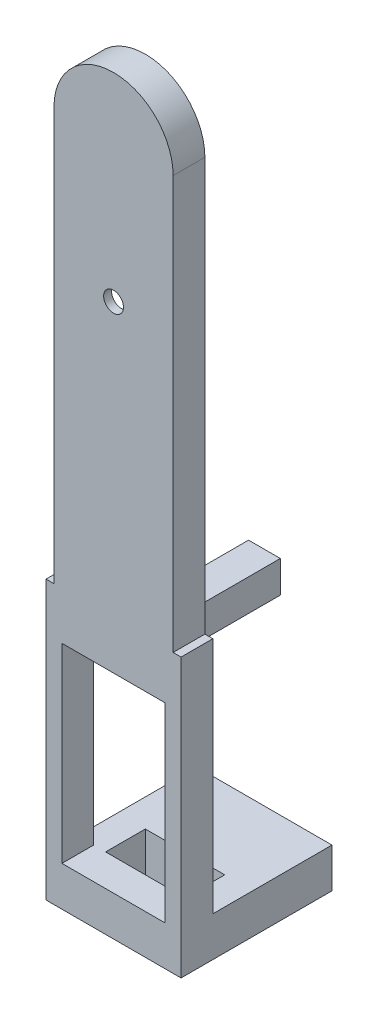
ISO-10303-21;
HEADER;
FILE_DESCRIPTION(('STEP AP214'),'2;1');
FILE_NAME('part.step','',(''),(''),'','','');
FILE_SCHEMA(('AUTOMOTIVE_DESIGN { 1 0 10303 214 1 1 1 1 }'));
ENDSEC;
DATA;
#1=APPLICATION_CONTEXT('core data for automotive mechanical design processes');
#2=APPLICATION_PROTOCOL_DEFINITION('international standard','automotive_design',2000,#1);
#3=PRODUCT_CONTEXT('',#1,'mechanical');
#4=PRODUCT('Part','Part','',(#3));
#5=PRODUCT_RELATED_PRODUCT_CATEGORY('part','',(#4));
#6=PRODUCT_DEFINITION_FORMATION('','',#4);
#7=PRODUCT_DEFINITION_CONTEXT('part definition',#1,'design');
#8=PRODUCT_DEFINITION('design','',#6,#7);
#9=PRODUCT_DEFINITION_SHAPE('','',#8);
#10=(LENGTH_UNIT() NAMED_UNIT(*) SI_UNIT(.MILLI.,.METRE.));
#11=(NAMED_UNIT(*) PLANE_ANGLE_UNIT() SI_UNIT($,.RADIAN.));
#12=(NAMED_UNIT(*) SI_UNIT($,.STERADIAN.) SOLID_ANGLE_UNIT());
#13=UNCERTAINTY_MEASURE_WITH_UNIT(LENGTH_MEASURE(1.E-05),#10,'distance_accuracy_value','');
#14=(GEOMETRIC_REPRESENTATION_CONTEXT(3) GLOBAL_UNCERTAINTY_ASSIGNED_CONTEXT((#13)) GLOBAL_UNIT_ASSIGNED_CONTEXT((#10,
#11,#12)) REPRESENTATION_CONTEXT('',''));
#15=CARTESIAN_POINT('',(0.,0.,0.));
#16=DIRECTION('',(0.,0.,1.));
#17=DIRECTION('',(1.,0.,0.));
#18=AXIS2_PLACEMENT_3D('',#15,#16,#17);
#19=CARTESIAN_POINT('',(0.,52.,0.));
#20=DIRECTION('',(0.,0.,1.));
#21=DIRECTION('',(1.,0.,0.));
#22=AXIS2_PLACEMENT_3D('',#19,#20,#21);
#23=PLANE('',#22);
#24=DIRECTION('',(1.,0.,0.));
#25=VECTOR('',#24,1.);
#26=CARTESIAN_POINT('',(-6.49999999999999,-30.,0.));
#27=LINE('',#26,#25);
#28=CARTESIAN_POINT('',(-5.,-30.,0.));
#29=VERTEX_POINT('',#28);
#30=CARTESIAN_POINT('',(5.,-30.,0.));
#31=VERTEX_POINT('',#30);
#32=EDGE_CURVE('E319',#29,#31,#27,.T.);
#33=ORIENTED_EDGE('',*,*,#32,.T.);
#34=DIRECTION('',(0.,-1.,0.));
#35=VECTOR('',#34,1.);
#36=CARTESIAN_POINT('',(5.,-30.,0.));
#37=LINE('',#36,#35);
#38=CARTESIAN_POINT('',(5.,-35.,0.));
#39=VERTEX_POINT('',#38);
#40=EDGE_CURVE('E248',#31,#39,#37,.T.);
#41=ORIENTED_EDGE('',*,*,#40,.T.);
#42=DIRECTION('',(1.,0.,0.));
#43=VECTOR('',#42,1.);
#44=CARTESIAN_POINT('',(8.50000000000001,-35.,0.));
#45=LINE('',#44,#43);
#46=CARTESIAN_POINT('',(-5.,-35.,0.));
#47=VERTEX_POINT('',#46);
#48=EDGE_CURVE('E354',#47,#39,#45,.T.);
#49=ORIENTED_EDGE('',*,*,#48,.F.);
#50=DIRECTION('',(0.,-1.,0.));
#51=VECTOR('',#50,1.);
#52=CARTESIAN_POINT('',(-5.,-30.,0.));
#53=LINE('',#52,#51);
#54=EDGE_CURVE('E276',#29,#47,#53,.T.);
#55=ORIENTED_EDGE('',*,*,#54,.F.);
#56=EDGE_LOOP('',(#33,#41,#49,#55));
#57=FACE_BOUND('',#56,.T.);
#58=ADVANCED_FACE('F38',(#57),#23,.F.);
#59=CARTESIAN_POINT('',(0.,52.,4.));
#60=DIRECTION('',(0.,0.,1.));
#61=DIRECTION('',(1.,0.,0.));
#62=AXIS2_PLACEMENT_3D('',#59,#60,#61);
#63=PLANE('',#62);
#64=CARTESIAN_POINT('',(0.,34.5,4.));
#65=DIRECTION('',(0.,0.,1.));
#66=DIRECTION('',(1.,0.,0.));
#67=AXIS2_PLACEMENT_3D('',#64,#65,#66);
#68=CIRCLE('',#67,1.25);
#69=CARTESIAN_POINT('',(1.25,34.5,4.));
#70=VERTEX_POINT('',#69);
#71=EDGE_CURVE('E381',#70,#70,#68,.F.);
#72=ORIENTED_EDGE('',*,*,#71,.T.);
#73=EDGE_LOOP('',(#72));
#74=FACE_BOUND('',#73,.T.);
#75=DIRECTION('',(0.,-1.,0.));
#76=VECTOR('',#75,1.);
#77=CARTESIAN_POINT('',(-7.5,0.,4.));
#78=LINE('',#77,#76);
#79=CARTESIAN_POINT('',(-7.5,52.,4.));
#80=VERTEX_POINT('',#79);
#81=CARTESIAN_POINT('',(-7.5,0.,4.));
#82=VERTEX_POINT('',#81);
#83=EDGE_CURVE('E434',#80,#82,#78,.T.);
#84=ORIENTED_EDGE('',*,*,#83,.T.);
#85=DIRECTION('',(-1.,0.,0.));
#86=VECTOR('',#85,1.);
#87=CARTESIAN_POINT('',(8.50000000000001,0.,4.));
#88=LINE('',#87,#86);
#89=CARTESIAN_POINT('',(-8.49999999999999,0.,4.));
#90=VERTEX_POINT('',#89);
#91=EDGE_CURVE('E353',#82,#90,#88,.T.);
#92=ORIENTED_EDGE('',*,*,#91,.T.);
#93=DIRECTION('',(0.,-1.,0.));
#94=VECTOR('',#93,1.);
#95=CARTESIAN_POINT('',(-8.49999999999999,0.,4.));
#96=LINE('',#95,#94);
#97=CARTESIAN_POINT('',(-8.49999999999999,-35.,4.));
#98=VERTEX_POINT('',#97);
#99=EDGE_CURVE('E358',#90,#98,#96,.T.);
#100=ORIENTED_EDGE('',*,*,#99,.T.);
#101=DIRECTION('',(1.,0.,0.));
#102=VECTOR('',#101,1.);
#103=CARTESIAN_POINT('',(8.50000000000001,-35.,4.));
#104=LINE('',#103,#102);
#105=CARTESIAN_POINT('',(8.50000000000001,-35.,4.));
#106=VERTEX_POINT('',#105);
#107=EDGE_CURVE('E360',#98,#106,#104,.T.);
#108=ORIENTED_EDGE('',*,*,#107,.T.);
#109=DIRECTION('',(0.,1.,0.));
#110=VECTOR('',#109,1.);
#111=CARTESIAN_POINT('',(8.50000000000001,0.,4.));
#112=LINE('',#111,#110);
#113=CARTESIAN_POINT('',(8.50000000000001,0.,4.));
#114=VERTEX_POINT('',#113);
#115=EDGE_CURVE('E350',#106,#114,#112,.T.);
#116=ORIENTED_EDGE('',*,*,#115,.T.);
#117=CARTESIAN_POINT('',(7.5,0.,4.));
#118=VERTEX_POINT('',#117);
#119=EDGE_CURVE('E355',#114,#118,#88,.T.);
#120=ORIENTED_EDGE('',*,*,#119,.T.);
#121=DIRECTION('',(0.,1.,0.));
#122=VECTOR('',#121,1.);
#123=CARTESIAN_POINT('',(7.5,0.,4.));
#124=LINE('',#123,#122);
#125=CARTESIAN_POINT('',(7.5,52.,4.));
#126=VERTEX_POINT('',#125);
#127=EDGE_CURVE('E429',#118,#126,#124,.T.);
#128=ORIENTED_EDGE('',*,*,#127,.T.);
#129=CARTESIAN_POINT('',(0.,52.,4.));
#130=DIRECTION('',(0.,0.,1.));
#131=DIRECTION('',(1.,0.,0.));
#132=AXIS2_PLACEMENT_3D('',#129,#130,#131);
#133=CIRCLE('',#132,7.5);
#134=EDGE_CURVE('E431',#126,#80,#133,.T.);
#135=ORIENTED_EDGE('',*,*,#134,.T.);
#136=EDGE_LOOP('',(#84,#92,#100,#108,#116,#120,#128,#135));
#137=FACE_BOUND('',#136,.T.);
#138=DIRECTION('',(-1.,0.,0.));
#139=VECTOR('',#138,1.);
#140=CARTESIAN_POINT('',(0.,-30.,4.));
#141=LINE('',#140,#139);
#142=CARTESIAN_POINT('',(6.50000000000001,-30.,4.));
#143=VERTEX_POINT('',#142);
#144=CARTESIAN_POINT('',(-6.49999999999999,-30.,4.));
#145=VERTEX_POINT('',#144);
#146=EDGE_CURVE('E344',#143,#145,#141,.T.);
#147=ORIENTED_EDGE('',*,*,#146,.T.);
#148=DIRECTION('',(0.,1.,0.));
#149=VECTOR('',#148,1.);
#150=CARTESIAN_POINT('',(-6.5,52.,4.));
#151=LINE('',#150,#149);
#152=CARTESIAN_POINT('',(-6.49999999999999,-6.,4.));
#153=VERTEX_POINT('',#152);
#154=EDGE_CURVE('E347',#145,#153,#151,.T.);
#155=ORIENTED_EDGE('',*,*,#154,.T.);
#156=DIRECTION('',(1.,0.,0.));
#157=VECTOR('',#156,1.);
#158=CARTESIAN_POINT('',(0.,-6.,4.));
#159=LINE('',#158,#157);
#160=CARTESIAN_POINT('',(6.50000000000001,-6.,4.));
#161=VERTEX_POINT('',#160);
#162=EDGE_CURVE('E338',#153,#161,#159,.T.);
#163=ORIENTED_EDGE('',*,*,#162,.T.);
#164=DIRECTION('',(0.,-1.,0.));
#165=VECTOR('',#164,1.);
#166=CARTESIAN_POINT('',(6.5,52.,4.));
#167=LINE('',#166,#165);
#168=EDGE_CURVE('E341',#161,#143,#167,.T.);
#169=ORIENTED_EDGE('',*,*,#168,.T.);
#170=EDGE_LOOP('',(#147,#155,#163,#169));
#171=FACE_BOUND('',#170,.T.);
#172=ADVANCED_FACE('F469',(#74,#137,#171),#63,.T.);
#173=DIRECTION('',(-0.161684528353418,0.986842496699009,0.));
#174=VECTOR('',#173,1.);
#175=CARTESIAN_POINT('',(10.3740127119628,1.69968090964537,0.));
#176=LINE('',#175,#174);
#177=CARTESIAN_POINT('',(5.,34.5,0.));
#178=VERTEX_POINT('',#177);
#179=CARTESIAN_POINT('',(2.13279550115704,52.,0.));
#180=VERTEX_POINT('',#179);
#181=EDGE_CURVE('E389',#178,#180,#176,.T.);
#182=ORIENTED_EDGE('',*,*,#181,.T.);
#183=CARTESIAN_POINT('',(0.,52.,0.));
#184=DIRECTION('',(0.,0.,1.));
#185=DIRECTION('',(1.,0.,0.));
#186=AXIS2_PLACEMENT_3D('',#183,#184,#185);
#187=CIRCLE('',#186,2.13279550115703);
#188=CARTESIAN_POINT('',(-2.13279550115703,52.,0.));
#189=VERTEX_POINT('',#188);
#190=EDGE_CURVE('E384',#189,#180,#187,.F.);
#191=ORIENTED_EDGE('',*,*,#190,.F.);
#192=DIRECTION('',(-0.161684528353418,-0.986842496699009,0.));
#193=VECTOR('',#192,1.);
#194=CARTESIAN_POINT('',(-10.3740127119628,1.69968090964537,0.));
#195=LINE('',#194,#193);
#196=CARTESIAN_POINT('',(-5.,34.5,0.));
#197=VERTEX_POINT('',#196);
#198=EDGE_CURVE('E402',#189,#197,#195,.T.);
#199=ORIENTED_EDGE('',*,*,#198,.T.);
#200=DIRECTION('',(0.161167236733303,-0.986927110684346,0.));
#201=VECTOR('',#200,1.);
#202=CARTESIAN_POINT('',(0.617455268354402,0.100831721339679,0.));
#203=LINE('',#202,#201);
#204=CARTESIAN_POINT('',(-2.14221383494361,17.,0.));
#205=VERTEX_POINT('',#204);
#206=EDGE_CURVE('E405',#197,#205,#203,.T.);
#207=ORIENTED_EDGE('',*,*,#206,.T.);
#208=CARTESIAN_POINT('',(0.,17.,0.));
#209=DIRECTION('',(0.,0.,1.));
#210=DIRECTION('',(1.,0.,0.));
#211=AXIS2_PLACEMENT_3D('',#208,#209,#210);
#212=CIRCLE('',#211,2.14221383494361);
#213=CARTESIAN_POINT('',(2.11474128897981,16.6580213525557,0.));
#214=VERTEX_POINT('',#213);
#215=EDGE_CURVE('E408',#205,#214,#212,.T.);
#216=ORIENTED_EDGE('',*,*,#215,.T.);
#217=DIRECTION('',(-0.159637960443524,-0.987175628541057,0.));
#218=VECTOR('',#217,1.);
#219=CARTESIAN_POINT('',(-0.564300677997616,0.091254085603361,0.));
#220=LINE('',#219,#218);
#221=EDGE_CURVE('E411',#178,#214,#220,.T.);
#222=ORIENTED_EDGE('',*,*,#221,.F.);
#223=EDGE_LOOP('',(#182,#191,#199,#207,#216,#222));
#224=FACE_BOUND('',#223,.T.);
#225=DIRECTION('',(0.,1.,0.));
#226=VECTOR('',#225,1.);
#227=CARTESIAN_POINT('',(8.50000000000001,0.,0.));
#228=LINE('',#227,#226);
#229=CARTESIAN_POINT('',(8.50000000000001,-30.,0.));
#230=VERTEX_POINT('',#229);
#231=CARTESIAN_POINT('',(8.50000000000001,0.,0.));
#232=VERTEX_POINT('',#231);
#233=EDGE_CURVE('E55',#230,#232,#228,.T.);
#234=ORIENTED_EDGE('',*,*,#233,.F.);
#235=DIRECTION('',(1.,0.,0.));
#236=VECTOR('',#235,1.);
#237=CARTESIAN_POINT('',(0.,-30.,0.));
#238=LINE('',#237,#236);
#239=CARTESIAN_POINT('',(6.50000000000001,-30.,0.));
#240=VERTEX_POINT('',#239);
#241=EDGE_CURVE('E252',#240,#230,#238,.T.);
#242=ORIENTED_EDGE('',*,*,#241,.F.);
#243=DIRECTION('',(0.,1.,0.));
#244=VECTOR('',#243,1.);
#245=CARTESIAN_POINT('',(6.50000000000001,-6.,0.));
#246=LINE('',#245,#244);
#247=CARTESIAN_POINT('',(6.50000000000001,-6.,0.));
#248=VERTEX_POINT('',#247);
#249=EDGE_CURVE('E321',#240,#248,#246,.T.);
#250=ORIENTED_EDGE('',*,*,#249,.T.);
#251=DIRECTION('',(-1.,0.,0.));
#252=VECTOR('',#251,1.);
#253=CARTESIAN_POINT('',(-6.49999999999999,-6.,0.));
#254=LINE('',#253,#252);
#255=CARTESIAN_POINT('',(2.00000000000001,-6.00000000000001,0.));
#256=VERTEX_POINT('',#255);
#257=EDGE_CURVE('E325',#248,#256,#254,.T.);
#258=ORIENTED_EDGE('',*,*,#257,.T.);
#259=DIRECTION('',(0.,1.,0.));
#260=VECTOR('',#259,1.);
#261=CARTESIAN_POINT('',(2.00000000000001,-2.00000000000001,0.));
#262=LINE('',#261,#260);
#263=CARTESIAN_POINT('',(2.00000000000001,-2.00000000000001,0.));
#264=VERTEX_POINT('',#263);
#265=EDGE_CURVE('E287',#256,#264,#262,.T.);
#266=ORIENTED_EDGE('',*,*,#265,.T.);
#267=DIRECTION('',(-1.,0.,0.));
#268=VECTOR('',#267,1.);
#269=CARTESIAN_POINT('',(2.00000000000001,-2.00000000000001,0.));
#270=LINE('',#269,#268);
#271=CARTESIAN_POINT('',(-1.99999999999999,-2.00000000000001,0.));
#272=VERTEX_POINT('',#271);
#273=EDGE_CURVE('E305',#264,#272,#270,.T.);
#274=ORIENTED_EDGE('',*,*,#273,.T.);
#275=DIRECTION('',(0.,-1.,0.));
#276=VECTOR('',#275,1.);
#277=CARTESIAN_POINT('',(-1.99999999999999,-2.00000000000001,0.));
#278=LINE('',#277,#276);
#279=CARTESIAN_POINT('',(-1.99999999999999,-6.,0.));
#280=VERTEX_POINT('',#279);
#281=EDGE_CURVE('E293',#272,#280,#278,.T.);
#282=ORIENTED_EDGE('',*,*,#281,.T.);
#283=CARTESIAN_POINT('',(-6.49999999999999,-6.,0.));
#284=VERTEX_POINT('',#283);
#285=EDGE_CURVE('E324',#280,#284,#254,.T.);
#286=ORIENTED_EDGE('',*,*,#285,.T.);
#287=DIRECTION('',(0.,-1.,0.));
#288=VECTOR('',#287,1.);
#289=CARTESIAN_POINT('',(-6.49999999999999,-6.,0.));
#290=LINE('',#289,#288);
#291=CARTESIAN_POINT('',(-6.49999999999999,-30.,0.));
#292=VERTEX_POINT('',#291);
#293=EDGE_CURVE('E312',#284,#292,#290,.T.);
#294=ORIENTED_EDGE('',*,*,#293,.T.);
#295=DIRECTION('',(1.,0.,0.));
#296=VECTOR('',#295,1.);
#297=CARTESIAN_POINT('',(0.,-30.,0.));
#298=LINE('',#297,#296);
#299=CARTESIAN_POINT('',(-8.49999999999999,-30.,0.));
#300=VERTEX_POINT('',#299);
#301=EDGE_CURVE('E62',#300,#292,#298,.T.);
#302=ORIENTED_EDGE('',*,*,#301,.F.);
#303=DIRECTION('',(0.,-1.,0.));
#304=VECTOR('',#303,1.);
#305=CARTESIAN_POINT('',(-8.49999999999999,0.,0.));
#306=LINE('',#305,#304);
#307=CARTESIAN_POINT('',(-8.49999999999999,0.,0.));
#308=VERTEX_POINT('',#307);
#309=EDGE_CURVE('E368',#308,#300,#306,.T.);
#310=ORIENTED_EDGE('',*,*,#309,.F.);
#311=DIRECTION('',(-1.,0.,0.));
#312=VECTOR('',#311,1.);
#313=CARTESIAN_POINT('',(8.50000000000001,0.,0.));
#314=LINE('',#313,#312);
#315=CARTESIAN_POINT('',(-7.5,0.,0.));
#316=VERTEX_POINT('',#315);
#317=EDGE_CURVE('E364',#316,#308,#314,.T.);
#318=ORIENTED_EDGE('',*,*,#317,.F.);
#319=DIRECTION('',(0.,-1.,0.));
#320=VECTOR('',#319,1.);
#321=CARTESIAN_POINT('',(-7.5,0.,0.));
#322=LINE('',#321,#320);
#323=CARTESIAN_POINT('',(-7.5,52.,0.));
#324=VERTEX_POINT('',#323);
#325=EDGE_CURVE('E432',#324,#316,#322,.T.);
#326=ORIENTED_EDGE('',*,*,#325,.F.);
#327=CARTESIAN_POINT('',(0.,52.,0.));
#328=DIRECTION('',(0.,0.,1.));
#329=DIRECTION('',(1.,0.,0.));
#330=AXIS2_PLACEMENT_3D('',#327,#328,#329);
#331=CIRCLE('',#330,7.5);
#332=CARTESIAN_POINT('',(7.5,52.,0.));
#333=VERTEX_POINT('',#332);
#334=EDGE_CURVE('E438',#333,#324,#331,.T.);
#335=ORIENTED_EDGE('',*,*,#334,.F.);
#336=DIRECTION('',(0.,1.,0.));
#337=VECTOR('',#336,1.);
#338=CARTESIAN_POINT('',(7.5,0.,0.));
#339=LINE('',#338,#337);
#340=CARTESIAN_POINT('',(7.5,0.,0.));
#341=VERTEX_POINT('',#340);
#342=EDGE_CURVE('E428',#341,#333,#339,.T.);
#343=ORIENTED_EDGE('',*,*,#342,.F.);
#344=EDGE_CURVE('E365',#232,#341,#314,.T.);
#345=ORIENTED_EDGE('',*,*,#344,.F.);
#346=EDGE_LOOP('',(#234,#242,#250,#258,#266,#274,#282,#286,#294,#302,#310,#318,#326,#335,#343,#345));
#347=FACE_BOUND('',#346,.T.);
#348=ADVANCED_FACE('F455',(#224,#347),#23,.F.);
#349=CARTESIAN_POINT('',(7.5,0.,4.));
#350=DIRECTION('',(-1.,0.,0.));
#351=DIRECTION('',(0.,0.,1.));
#352=AXIS2_PLACEMENT_3D('',#349,#350,#351);
#353=PLANE('',#352);
#354=ORIENTED_EDGE('',*,*,#342,.T.);
#355=DIRECTION('',(0.,0.,-1.));
#356=VECTOR('',#355,1.);
#357=CARTESIAN_POINT('',(7.5,52.,4.));
#358=LINE('',#357,#356);
#359=EDGE_CURVE('E446',#126,#333,#358,.T.);
#360=ORIENTED_EDGE('',*,*,#359,.F.);
#361=ORIENTED_EDGE('',*,*,#127,.F.);
#362=DIRECTION('',(0.,0.,-1.));
#363=VECTOR('',#362,1.);
#364=CARTESIAN_POINT('',(7.5,0.,4.));
#365=LINE('',#364,#363);
#366=EDGE_CURVE('E47',#118,#341,#365,.T.);
#367=ORIENTED_EDGE('',*,*,#366,.T.);
#368=EDGE_LOOP('',(#354,#360,#361,#367));
#369=FACE_BOUND('',#368,.T.);
#370=ADVANCED_FACE('F40',(#369),#353,.F.);
#371=CARTESIAN_POINT('',(0.,52.,4.));
#372=DIRECTION('',(0.,0.,-1.));
#373=DIRECTION('',(-1.,0.,0.));
#374=AXIS2_PLACEMENT_3D('',#371,#372,#373);
#375=CYLINDRICAL_SURFACE('',#374,7.5);
#376=ORIENTED_EDGE('',*,*,#334,.T.);
#377=DIRECTION('',(0.,0.,-1.));
#378=VECTOR('',#377,1.);
#379=CARTESIAN_POINT('',(-7.5,52.,4.));
#380=LINE('',#379,#378);
#381=EDGE_CURVE('E443',#80,#324,#380,.T.);
#382=ORIENTED_EDGE('',*,*,#381,.F.);
#383=ORIENTED_EDGE('',*,*,#134,.F.);
#384=ORIENTED_EDGE('',*,*,#359,.T.);
#385=EDGE_LOOP('',(#376,#382,#383,#384));
#386=FACE_BOUND('',#385,.T.);
#387=ADVANCED_FACE('F461',(#386),#375,.T.);
#388=CARTESIAN_POINT('',(-7.5,0.,4.));
#389=DIRECTION('',(1.,0.,0.));
#390=DIRECTION('',(0.,0.,-1.));
#391=AXIS2_PLACEMENT_3D('',#388,#389,#390);
#392=PLANE('',#391);
#393=ORIENTED_EDGE('',*,*,#325,.T.);
#394=DIRECTION('',(0.,0.,-1.));
#395=VECTOR('',#394,1.);
#396=CARTESIAN_POINT('',(-7.5,0.,4.));
#397=LINE('',#396,#395);
#398=EDGE_CURVE('E436',#82,#316,#397,.T.);
#399=ORIENTED_EDGE('',*,*,#398,.F.);
#400=ORIENTED_EDGE('',*,*,#83,.F.);
#401=ORIENTED_EDGE('',*,*,#381,.T.);
#402=EDGE_LOOP('',(#393,#399,#400,#401));
#403=FACE_BOUND('',#402,.T.);
#404=ADVANCED_FACE('F465',(#403),#392,.F.);
#405=CARTESIAN_POINT('',(0.,52.,3.));
#406=DIRECTION('',(0.,0.,-1.));
#407=DIRECTION('',(-1.,0.,0.));
#408=AXIS2_PLACEMENT_3D('',#405,#406,#407);
#409=CYLINDRICAL_SURFACE('',#408,2.13279550115703);
#410=ORIENTED_EDGE('',*,*,#190,.T.);
#411=DIRECTION('',(0.,0.,-1.));
#412=VECTOR('',#411,1.);
#413=CARTESIAN_POINT('',(2.13279550115704,52.,3.));
#414=LINE('',#413,#412);
#415=CARTESIAN_POINT('',(2.13279550115704,52.,3.));
#416=VERTEX_POINT('',#415);
#417=EDGE_CURVE('E400',#416,#180,#414,.T.);
#418=ORIENTED_EDGE('',*,*,#417,.F.);
#419=CARTESIAN_POINT('',(0.,52.,3.));
#420=DIRECTION('',(0.,0.,1.));
#421=DIRECTION('',(1.,0.,0.));
#422=AXIS2_PLACEMENT_3D('',#419,#420,#421);
#423=CIRCLE('',#422,2.13279550115703);
#424=CARTESIAN_POINT('',(-2.13279550115703,52.,3.));
#425=VERTEX_POINT('',#424);
#426=EDGE_CURVE('E385',#425,#416,#423,.F.);
#427=ORIENTED_EDGE('',*,*,#426,.F.);
#428=DIRECTION('',(0.,0.,-1.));
#429=VECTOR('',#428,1.);
#430=CARTESIAN_POINT('',(-2.13279550115703,52.,3.));
#431=LINE('',#430,#429);
#432=EDGE_CURVE('E426',#425,#189,#431,.T.);
#433=ORIENTED_EDGE('',*,*,#432,.T.);
#434=EDGE_LOOP('',(#410,#418,#427,#433));
#435=FACE_BOUND('',#434,.T.);
#436=ADVANCED_FACE('F520',(#435),#409,.F.);
#437=CARTESIAN_POINT('',(-10.3740127119628,1.69968090964537,3.));
#438=DIRECTION('',(0.986842496699008,-0.161684528353418,0.));
#439=DIRECTION('',(0.161684528353418,0.986842496699009,0.));
#440=AXIS2_PLACEMENT_3D('',#437,#438,#439);
#441=PLANE('',#440);
#442=ORIENTED_EDGE('',*,*,#198,.F.);
#443=ORIENTED_EDGE('',*,*,#432,.F.);
#444=DIRECTION('',(-0.161684528353418,-0.986842496699009,0.));
#445=VECTOR('',#444,1.);
#446=CARTESIAN_POINT('',(-10.3740127119628,1.69968090964537,3.));
#447=LINE('',#446,#445);
#448=CARTESIAN_POINT('',(-5.,34.5,3.));
#449=VERTEX_POINT('',#448);
#450=EDGE_CURVE('E388',#425,#449,#447,.T.);
#451=ORIENTED_EDGE('',*,*,#450,.T.);
#452=DIRECTION('',(0.,0.,-1.));
#453=VECTOR('',#452,1.);
#454=CARTESIAN_POINT('',(-5.,34.5,3.));
#455=LINE('',#454,#453);
#456=EDGE_CURVE('E424',#449,#197,#455,.T.);
#457=ORIENTED_EDGE('',*,*,#456,.T.);
#458=EDGE_LOOP('',(#442,#443,#451,#457));
#459=FACE_BOUND('',#458,.T.);
#460=ADVANCED_FACE('F691',(#459),#441,.T.);
#461=CARTESIAN_POINT('',(0.617455268354402,0.100831721339679,3.));
#462=DIRECTION('',(0.986927110684346,0.161167236733303,0.));
#463=DIRECTION('',(-0.161167236733303,0.986927110684346,0.));
#464=AXIS2_PLACEMENT_3D('',#461,#462,#463);
#465=PLANE('',#464);
#466=ORIENTED_EDGE('',*,*,#206,.F.);
#467=ORIENTED_EDGE('',*,*,#456,.F.);
#468=DIRECTION('',(0.161167236733303,-0.986927110684346,0.));
#469=VECTOR('',#468,1.);
#470=CARTESIAN_POINT('',(0.617455268354402,0.100831721339679,3.));
#471=LINE('',#470,#469);
#472=CARTESIAN_POINT('',(-2.14221383494361,17.,3.));
#473=VERTEX_POINT('',#472);
#474=EDGE_CURVE('E391',#449,#473,#471,.T.);
#475=ORIENTED_EDGE('',*,*,#474,.T.);
#476=DIRECTION('',(0.,0.,-1.));
#477=VECTOR('',#476,1.);
#478=CARTESIAN_POINT('',(-2.14221383494361,17.,3.));
#479=LINE('',#478,#477);
#480=EDGE_CURVE('E422',#473,#205,#479,.T.);
#481=ORIENTED_EDGE('',*,*,#480,.T.);
#482=EDGE_LOOP('',(#466,#467,#475,#481));
#483=FACE_BOUND('',#482,.T.);
#484=ADVANCED_FACE('F688',(#483),#465,.T.);
#485=CARTESIAN_POINT('',(0.,17.,3.));
#486=DIRECTION('',(0.,0.,-1.));
#487=DIRECTION('',(-1.,0.,0.));
#488=AXIS2_PLACEMENT_3D('',#485,#486,#487);
#489=CYLINDRICAL_SURFACE('',#488,2.14221383494361);
#490=ORIENTED_EDGE('',*,*,#215,.F.);
#491=ORIENTED_EDGE('',*,*,#480,.F.);
#492=CARTESIAN_POINT('',(0.,17.,3.));
#493=DIRECTION('',(0.,0.,1.));
#494=DIRECTION('',(1.,0.,0.));
#495=AXIS2_PLACEMENT_3D('',#492,#493,#494);
#496=CIRCLE('',#495,2.14221383494361);
#497=CARTESIAN_POINT('',(2.11474128897981,16.6580213525557,3.));
#498=VERTEX_POINT('',#497);
#499=EDGE_CURVE('E393',#473,#498,#496,.T.);
#500=ORIENTED_EDGE('',*,*,#499,.T.);
#501=DIRECTION('',(0.,0.,-1.));
#502=VECTOR('',#501,1.);
#503=CARTESIAN_POINT('',(2.11474128897981,16.6580213525557,3.));
#504=LINE('',#503,#502);
#505=EDGE_CURVE('E420',#498,#214,#504,.T.);
#506=ORIENTED_EDGE('',*,*,#505,.T.);
#507=EDGE_LOOP('',(#490,#491,#500,#506));
#508=FACE_BOUND('',#507,.T.);
#509=ADVANCED_FACE('F684',(#508),#489,.F.);
#510=CARTESIAN_POINT('',(-0.564300677997616,0.091254085603361,3.));
#511=DIRECTION('',(0.987175628541057,-0.159637960443524,0.));
#512=DIRECTION('',(0.159637960443524,0.987175628541057,0.));
#513=AXIS2_PLACEMENT_3D('',#510,#511,#512);
#514=PLANE('',#513);
#515=ORIENTED_EDGE('',*,*,#221,.T.);
#516=ORIENTED_EDGE('',*,*,#505,.F.);
#517=DIRECTION('',(-0.159637960443524,-0.987175628541057,0.));
#518=VECTOR('',#517,1.);
#519=CARTESIAN_POINT('',(-0.564300677997616,0.091254085603361,3.));
#520=LINE('',#519,#518);
#521=CARTESIAN_POINT('',(5.,34.5,3.));
#522=VERTEX_POINT('',#521);
#523=EDGE_CURVE('E395',#522,#498,#520,.T.);
#524=ORIENTED_EDGE('',*,*,#523,.F.);
#525=DIRECTION('',(0.,0.,-1.));
#526=VECTOR('',#525,1.);
#527=CARTESIAN_POINT('',(5.,34.5,3.));
#528=LINE('',#527,#526);
#529=EDGE_CURVE('E418',#522,#178,#528,.T.);
#530=ORIENTED_EDGE('',*,*,#529,.T.);
#531=EDGE_LOOP('',(#515,#516,#524,#530));
#532=FACE_BOUND('',#531,.T.);
#533=ADVANCED_FACE('F680',(#532),#514,.F.);
#534=CARTESIAN_POINT('',(10.3740127119628,1.69968090964537,3.));
#535=DIRECTION('',(-0.986842496699008,-0.161684528353418,0.));
#536=DIRECTION('',(0.161684528353418,-0.986842496699009,0.));
#537=AXIS2_PLACEMENT_3D('',#534,#535,#536);
#538=PLANE('',#537);
#539=ORIENTED_EDGE('',*,*,#181,.F.);
#540=ORIENTED_EDGE('',*,*,#529,.F.);
#541=DIRECTION('',(-0.161684528353418,0.986842496699009,0.));
#542=VECTOR('',#541,1.);
#543=CARTESIAN_POINT('',(10.3740127119628,1.69968090964537,3.));
#544=LINE('',#543,#542);
#545=EDGE_CURVE('E398',#522,#416,#544,.T.);
#546=ORIENTED_EDGE('',*,*,#545,.T.);
#547=ORIENTED_EDGE('',*,*,#417,.T.);
#548=EDGE_LOOP('',(#539,#540,#546,#547));
#549=FACE_BOUND('',#548,.T.);
#550=ADVANCED_FACE('F676',(#549),#538,.T.);
#551=CARTESIAN_POINT('',(0.,0.,3.));
#552=DIRECTION('',(0.,0.,1.));
#553=DIRECTION('',(1.,0.,0.));
#554=AXIS2_PLACEMENT_3D('',#551,#552,#553);
#555=PLANE('',#554);
#556=CARTESIAN_POINT('',(0.,34.5,3.));
#557=DIRECTION('',(0.,0.,1.));
#558=DIRECTION('',(1.,0.,0.));
#559=AXIS2_PLACEMENT_3D('',#556,#557,#558);
#560=CIRCLE('',#559,1.25);
#561=CARTESIAN_POINT('',(1.25,34.5,3.));
#562=VERTEX_POINT('',#561);
#563=EDGE_CURVE('E42',#562,#562,#560,.F.);
#564=ORIENTED_EDGE('',*,*,#563,.F.);
#565=EDGE_LOOP('',(#564));
#566=FACE_BOUND('',#565,.T.);
#567=ORIENTED_EDGE('',*,*,#426,.T.);
#568=ORIENTED_EDGE('',*,*,#545,.F.);
#569=ORIENTED_EDGE('',*,*,#523,.T.);
#570=ORIENTED_EDGE('',*,*,#499,.F.);
#571=ORIENTED_EDGE('',*,*,#474,.F.);
#572=ORIENTED_EDGE('',*,*,#450,.F.);
#573=EDGE_LOOP('',(#567,#568,#569,#570,#571,#572));
#574=FACE_BOUND('',#573,.T.);
#575=ADVANCED_FACE('F672',(#566,#574),#555,.F.);
#576=CARTESIAN_POINT('',(0.,34.5,12.4));
#577=DIRECTION('',(0.,0.,-1.));
#578=DIRECTION('',(-1.,0.,0.));
#579=AXIS2_PLACEMENT_3D('',#576,#577,#578);
#580=CYLINDRICAL_SURFACE('',#579,1.25);
#581=ORIENTED_EDGE('',*,*,#71,.F.);
#582=EDGE_LOOP('',(#581));
#583=FACE_BOUND('',#582,.T.);
#584=ORIENTED_EDGE('',*,*,#563,.T.);
#585=EDGE_LOOP('',(#584));
#586=FACE_BOUND('',#585,.T.);
#587=ADVANCED_FACE('F669',(#583,#586),#580,.F.);
#588=CARTESIAN_POINT('',(8.50000000000001,0.,4.));
#589=DIRECTION('',(0.,-1.,0.));
#590=DIRECTION('',(1.,0.,0.));
#591=AXIS2_PLACEMENT_3D('',#588,#589,#590);
#592=PLANE('',#591);
#593=ORIENTED_EDGE('',*,*,#91,.F.);
#594=ORIENTED_EDGE('',*,*,#398,.T.);
#595=ORIENTED_EDGE('',*,*,#317,.T.);
#596=DIRECTION('',(0.,0.,-1.));
#597=VECTOR('',#596,1.);
#598=CARTESIAN_POINT('',(-8.49999999999999,0.,4.));
#599=LINE('',#598,#597);
#600=EDGE_CURVE('E375',#90,#308,#599,.T.);
#601=ORIENTED_EDGE('',*,*,#600,.F.);
#602=EDGE_LOOP('',(#593,#594,#595,#601));
#603=FACE_BOUND('',#602,.T.);
#604=ADVANCED_FACE('F551',(#603),#592,.F.);
#605=CARTESIAN_POINT('',(8.50000000000001,0.,4.));
#606=DIRECTION('',(-1.,0.,0.));
#607=DIRECTION('',(0.,-1.,0.));
#608=AXIS2_PLACEMENT_3D('',#605,#606,#607);
#609=PLANE('',#608);
#610=DIRECTION('',(0.,0.,-1.));
#611=VECTOR('',#610,1.);
#612=CARTESIAN_POINT('',(8.50000000000001,-35.,4.));
#613=LINE('',#612,#611);
#614=CARTESIAN_POINT('',(8.50000000000001,-35.,-15.));
#615=VERTEX_POINT('',#614);
#616=EDGE_CURVE('E362',#106,#615,#613,.T.);
#617=ORIENTED_EDGE('',*,*,#616,.T.);
#618=DIRECTION('',(0.,-1.,0.));
#619=VECTOR('',#618,1.);
#620=CARTESIAN_POINT('',(8.50000000000001,-30.,-15.));
#621=LINE('',#620,#619);
#622=CARTESIAN_POINT('',(8.50000000000001,-30.,-15.));
#623=VERTEX_POINT('',#622);
#624=EDGE_CURVE('E282',#623,#615,#621,.T.);
#625=ORIENTED_EDGE('',*,*,#624,.F.);
#626=DIRECTION('',(0.,0.,-1.));
#627=VECTOR('',#626,1.);
#628=CARTESIAN_POINT('',(8.50000000000001,-30.,0.));
#629=LINE('',#628,#627);
#630=EDGE_CURVE('E254',#230,#623,#629,.T.);
#631=ORIENTED_EDGE('',*,*,#630,.F.);
#632=ORIENTED_EDGE('',*,*,#233,.T.);
#633=DIRECTION('',(0.,0.,-1.));
#634=VECTOR('',#633,1.);
#635=CARTESIAN_POINT('',(8.50000000000001,0.,4.));
#636=LINE('',#635,#634);
#637=EDGE_CURVE('E378',#114,#232,#636,.T.);
#638=ORIENTED_EDGE('',*,*,#637,.F.);
#639=ORIENTED_EDGE('',*,*,#115,.F.);
#640=EDGE_LOOP('',(#617,#625,#631,#632,#638,#639));
#641=FACE_BOUND('',#640,.T.);
#642=ADVANCED_FACE('F476',(#641),#609,.F.);
#643=ORIENTED_EDGE('',*,*,#366,.F.);
#644=ORIENTED_EDGE('',*,*,#119,.F.);
#645=ORIENTED_EDGE('',*,*,#637,.T.);
#646=ORIENTED_EDGE('',*,*,#344,.T.);
#647=EDGE_LOOP('',(#643,#644,#645,#646));
#648=FACE_BOUND('',#647,.T.);
#649=ADVANCED_FACE('F453',(#648),#592,.F.);
#650=CARTESIAN_POINT('',(-8.49999999999999,0.,4.));
#651=DIRECTION('',(1.,0.,0.));
#652=DIRECTION('',(0.,1.,0.));
#653=AXIS2_PLACEMENT_3D('',#650,#651,#652);
#654=PLANE('',#653);
#655=ORIENTED_EDGE('',*,*,#309,.T.);
#656=DIRECTION('',(0.,0.,1.));
#657=VECTOR('',#656,1.);
#658=CARTESIAN_POINT('',(-8.50000000000001,-30.,0.));
#659=LINE('',#658,#657);
#660=CARTESIAN_POINT('',(-8.50000000000001,-30.,-15.));
#661=VERTEX_POINT('',#660);
#662=EDGE_CURVE('E261',#661,#300,#659,.T.);
#663=ORIENTED_EDGE('',*,*,#662,.F.);
#664=DIRECTION('',(0.,-1.,0.));
#665=VECTOR('',#664,1.);
#666=CARTESIAN_POINT('',(-8.50000000000001,-30.,-15.));
#667=LINE('',#666,#665);
#668=CARTESIAN_POINT('',(-8.50000000000001,-35.,-15.));
#669=VERTEX_POINT('',#668);
#670=EDGE_CURVE('E279',#661,#669,#667,.T.);
#671=ORIENTED_EDGE('',*,*,#670,.T.);
#672=DIRECTION('',(0.,0.,-1.));
#673=VECTOR('',#672,1.);
#674=CARTESIAN_POINT('',(-8.49999999999999,-35.,4.));
#675=LINE('',#674,#673);
#676=EDGE_CURVE('E373',#98,#669,#675,.T.);
#677=ORIENTED_EDGE('',*,*,#676,.F.);
#678=ORIENTED_EDGE('',*,*,#99,.F.);
#679=ORIENTED_EDGE('',*,*,#600,.T.);
#680=EDGE_LOOP('',(#655,#663,#671,#677,#678,#679));
#681=FACE_BOUND('',#680,.T.);
#682=ADVANCED_FACE('F560',(#681),#654,.F.);
#683=CARTESIAN_POINT('',(8.50000000000001,-35.,4.));
#684=DIRECTION('',(0.,1.,0.));
#685=DIRECTION('',(0.,0.,1.));
#686=AXIS2_PLACEMENT_3D('',#683,#684,#685);
#687=PLANE('',#686);
#688=DIRECTION('',(-1.,0.,0.));
#689=VECTOR('',#688,1.);
#690=CARTESIAN_POINT('',(0.,-35.,-15.));
#691=LINE('',#690,#689);
#692=EDGE_CURVE('E271',#615,#669,#691,.T.);
#693=ORIENTED_EDGE('',*,*,#692,.F.);
#694=ORIENTED_EDGE('',*,*,#616,.F.);
#695=ORIENTED_EDGE('',*,*,#107,.F.);
#696=ORIENTED_EDGE('',*,*,#676,.T.);
#697=EDGE_LOOP('',(#693,#694,#695,#696));
#698=FACE_BOUND('',#697,.T.);
#699=ORIENTED_EDGE('',*,*,#48,.T.);
#700=DIRECTION('',(0.,0.,-1.));
#701=VECTOR('',#700,1.);
#702=CARTESIAN_POINT('',(5.,-35.,0.));
#703=LINE('',#702,#701);
#704=CARTESIAN_POINT('',(5.,-35.,-5.));
#705=VERTEX_POINT('',#704);
#706=EDGE_CURVE('E268',#39,#705,#703,.T.);
#707=ORIENTED_EDGE('',*,*,#706,.T.);
#708=DIRECTION('',(1.,0.,0.));
#709=VECTOR('',#708,1.);
#710=CARTESIAN_POINT('',(0.,-35.,-5.));
#711=LINE('',#710,#709);
#712=CARTESIAN_POINT('',(-5.,-35.,-5.));
#713=VERTEX_POINT('',#712);
#714=EDGE_CURVE('E243',#713,#705,#711,.T.);
#715=ORIENTED_EDGE('',*,*,#714,.F.);
#716=DIRECTION('',(0.,0.,-1.));
#717=VECTOR('',#716,1.);
#718=CARTESIAN_POINT('',(-5.,-35.,0.));
#719=LINE('',#718,#717);
#720=EDGE_CURVE('E237',#47,#713,#719,.T.);
#721=ORIENTED_EDGE('',*,*,#720,.F.);
#722=EDGE_LOOP('',(#699,#707,#715,#721));
#723=FACE_BOUND('',#722,.T.);
#724=ADVANCED_FACE('F564',(#698,#723),#687,.F.);
#725=CARTESIAN_POINT('',(-6.49999999999999,-6.,12.1));
#726=DIRECTION('',(1.,0.,0.));
#727=DIRECTION('',(0.,1.,0.));
#728=AXIS2_PLACEMENT_3D('',#725,#726,#727);
#729=PLANE('',#728);
#730=DIRECTION('',(0.,0.,-1.));
#731=VECTOR('',#730,1.);
#732=CARTESIAN_POINT('',(-6.49999999999999,-30.,12.1));
#733=LINE('',#732,#731);
#734=EDGE_CURVE('E336',#145,#292,#733,.T.);
#735=ORIENTED_EDGE('',*,*,#734,.T.);
#736=ORIENTED_EDGE('',*,*,#293,.F.);
#737=DIRECTION('',(0.,0.,-1.));
#738=VECTOR('',#737,1.);
#739=CARTESIAN_POINT('',(-6.49999999999999,-6.,12.1));
#740=LINE('',#739,#738);
#741=EDGE_CURVE('E328',#153,#284,#740,.T.);
#742=ORIENTED_EDGE('',*,*,#741,.F.);
#743=ORIENTED_EDGE('',*,*,#154,.F.);
#744=EDGE_LOOP('',(#735,#736,#742,#743));
#745=FACE_BOUND('',#744,.T.);
#746=ADVANCED_FACE('F506',(#745),#729,.T.);
#747=CARTESIAN_POINT('',(-6.49999999999999,-30.,12.1));
#748=DIRECTION('',(0.,1.,0.));
#749=DIRECTION('',(0.,0.,1.));
#750=AXIS2_PLACEMENT_3D('',#747,#748,#749);
#751=PLANE('',#750);
#752=DIRECTION('',(0.,0.,-1.));
#753=VECTOR('',#752,1.);
#754=CARTESIAN_POINT('',(6.50000000000001,-30.,12.1));
#755=LINE('',#754,#753);
#756=EDGE_CURVE('E333',#143,#240,#755,.T.);
#757=ORIENTED_EDGE('',*,*,#756,.T.);
#758=ORIENTED_EDGE('',*,*,#241,.T.);
#759=ORIENTED_EDGE('',*,*,#630,.T.);
#760=DIRECTION('',(-1.,0.,0.));
#761=VECTOR('',#760,1.);
#762=CARTESIAN_POINT('',(0.,-30.,-15.));
#763=LINE('',#762,#761);
#764=EDGE_CURVE('E259',#623,#661,#763,.T.);
#765=ORIENTED_EDGE('',*,*,#764,.T.);
#766=ORIENTED_EDGE('',*,*,#662,.T.);
#767=ORIENTED_EDGE('',*,*,#301,.T.);
#768=ORIENTED_EDGE('',*,*,#734,.F.);
#769=ORIENTED_EDGE('',*,*,#146,.F.);
#770=EDGE_LOOP('',(#757,#758,#759,#765,#766,#767,#768,#769));
#771=FACE_BOUND('',#770,.T.);
#772=DIRECTION('',(0.,0.,-1.));
#773=VECTOR('',#772,1.);
#774=CARTESIAN_POINT('',(5.,-30.,0.));
#775=LINE('',#774,#773);
#776=CARTESIAN_POINT('',(5.,-30.,-5.));
#777=VERTEX_POINT('',#776);
#778=EDGE_CURVE('E231',#31,#777,#775,.T.);
#779=ORIENTED_EDGE('',*,*,#778,.F.);
#780=ORIENTED_EDGE('',*,*,#32,.F.);
#781=DIRECTION('',(0.,0.,-1.));
#782=VECTOR('',#781,1.);
#783=CARTESIAN_POINT('',(-5.,-30.,0.));
#784=LINE('',#783,#782);
#785=CARTESIAN_POINT('',(-5.,-30.,-5.));
#786=VERTEX_POINT('',#785);
#787=EDGE_CURVE('E233',#29,#786,#784,.T.);
#788=ORIENTED_EDGE('',*,*,#787,.T.);
#789=DIRECTION('',(1.,0.,0.));
#790=VECTOR('',#789,1.);
#791=CARTESIAN_POINT('',(0.,-30.,-5.));
#792=LINE('',#791,#790);
#793=EDGE_CURVE('E227',#786,#777,#792,.T.);
#794=ORIENTED_EDGE('',*,*,#793,.T.);
#795=EDGE_LOOP('',(#779,#780,#788,#794));
#796=FACE_BOUND('',#795,.T.);
#797=ADVANCED_FACE('F229',(#771,#796),#751,.T.);
#798=CARTESIAN_POINT('',(6.50000000000001,-6.,12.1));
#799=DIRECTION('',(-1.,0.,0.));
#800=DIRECTION('',(0.,-1.,0.));
#801=AXIS2_PLACEMENT_3D('',#798,#799,#800);
#802=PLANE('',#801);
#803=DIRECTION('',(0.,0.,-1.));
#804=VECTOR('',#803,1.);
#805=CARTESIAN_POINT('',(6.50000000000001,-6.,12.1));
#806=LINE('',#805,#804);
#807=EDGE_CURVE('E331',#161,#248,#806,.T.);
#808=ORIENTED_EDGE('',*,*,#807,.T.);
#809=ORIENTED_EDGE('',*,*,#249,.F.);
#810=ORIENTED_EDGE('',*,*,#756,.F.);
#811=ORIENTED_EDGE('',*,*,#168,.F.);
#812=EDGE_LOOP('',(#808,#809,#810,#811));
#813=FACE_BOUND('',#812,.T.);
#814=ADVANCED_FACE('F485',(#813),#802,.T.);
#815=CARTESIAN_POINT('',(-6.49999999999999,-6.,12.1));
#816=DIRECTION('',(0.,-1.,0.));
#817=DIRECTION('',(0.,0.,-1.));
#818=AXIS2_PLACEMENT_3D('',#815,#816,#817);
#819=PLANE('',#818);
#820=ORIENTED_EDGE('',*,*,#741,.T.);
#821=ORIENTED_EDGE('',*,*,#285,.F.);
#822=DIRECTION('',(0.,0.,1.));
#823=VECTOR('',#822,1.);
#824=CARTESIAN_POINT('',(-1.99999999999999,-6.00000000000001,-15.));
#825=LINE('',#824,#823);
#826=CARTESIAN_POINT('',(-1.99999999999999,-6.00000000000001,-15.));
#827=VERTEX_POINT('',#826);
#828=EDGE_CURVE('E313',#827,#280,#825,.T.);
#829=ORIENTED_EDGE('',*,*,#828,.F.);
#830=DIRECTION('',(1.,0.,0.));
#831=VECTOR('',#830,1.);
#832=CARTESIAN_POINT('',(2.00000000000001,-6.00000000000001,-15.));
#833=LINE('',#832,#831);
#834=CARTESIAN_POINT('',(2.00000000000001,-6.00000000000001,-15.));
#835=VERTEX_POINT('',#834);
#836=EDGE_CURVE('E299',#827,#835,#833,.T.);
#837=ORIENTED_EDGE('',*,*,#836,.T.);
#838=DIRECTION('',(0.,0.,1.));
#839=VECTOR('',#838,1.);
#840=CARTESIAN_POINT('',(2.00000000000001,-6.00000000000001,-15.));
#841=LINE('',#840,#839);
#842=EDGE_CURVE('E310',#835,#256,#841,.T.);
#843=ORIENTED_EDGE('',*,*,#842,.T.);
#844=ORIENTED_EDGE('',*,*,#257,.F.);
#845=ORIENTED_EDGE('',*,*,#807,.F.);
#846=ORIENTED_EDGE('',*,*,#162,.F.);
#847=EDGE_LOOP('',(#820,#821,#829,#837,#843,#844,#845,#846));
#848=FACE_BOUND('',#847,.T.);
#849=ADVANCED_FACE('F488',(#848),#819,.T.);
#850=CARTESIAN_POINT('',(2.00000000000001,-2.00000000000001,-15.));
#851=DIRECTION('',(1.,0.,0.));
#852=DIRECTION('',(0.,1.,0.));
#853=AXIS2_PLACEMENT_3D('',#850,#851,#852);
#854=PLANE('',#853);
#855=ORIENTED_EDGE('',*,*,#265,.F.);
#856=ORIENTED_EDGE('',*,*,#842,.F.);
#857=DIRECTION('',(0.,1.,0.));
#858=VECTOR('',#857,1.);
#859=CARTESIAN_POINT('',(2.00000000000001,-2.00000000000001,-15.));
#860=LINE('',#859,#858);
#861=CARTESIAN_POINT('',(2.00000000000001,-2.00000000000001,-15.));
#862=VERTEX_POINT('',#861);
#863=EDGE_CURVE('E289',#835,#862,#860,.T.);
#864=ORIENTED_EDGE('',*,*,#863,.T.);
#865=DIRECTION('',(0.,0.,1.));
#866=VECTOR('',#865,1.);
#867=CARTESIAN_POINT('',(2.00000000000001,-2.00000000000001,-15.));
#868=LINE('',#867,#866);
#869=EDGE_CURVE('E302',#862,#264,#868,.T.);
#870=ORIENTED_EDGE('',*,*,#869,.T.);
#871=EDGE_LOOP('',(#855,#856,#864,#870));
#872=FACE_BOUND('',#871,.T.);
#873=ADVANCED_FACE('F493',(#872),#854,.T.);
#874=CARTESIAN_POINT('',(-1.99999999999999,-2.00000000000001,-15.));
#875=DIRECTION('',(-1.,0.,0.));
#876=DIRECTION('',(0.,-1.,0.));
#877=AXIS2_PLACEMENT_3D('',#874,#875,#876);
#878=PLANE('',#877);
#879=ORIENTED_EDGE('',*,*,#281,.F.);
#880=DIRECTION('',(0.,0.,1.));
#881=VECTOR('',#880,1.);
#882=CARTESIAN_POINT('',(-1.99999999999999,-2.00000000000001,-15.));
#883=LINE('',#882,#881);
#884=CARTESIAN_POINT('',(-1.99999999999999,-2.00000000000001,-15.));
#885=VERTEX_POINT('',#884);
#886=EDGE_CURVE('E315',#885,#272,#883,.T.);
#887=ORIENTED_EDGE('',*,*,#886,.F.);
#888=DIRECTION('',(0.,-1.,0.));
#889=VECTOR('',#888,1.);
#890=CARTESIAN_POINT('',(-1.99999999999999,-2.00000000000001,-15.));
#891=LINE('',#890,#889);
#892=EDGE_CURVE('E296',#885,#827,#891,.T.);
#893=ORIENTED_EDGE('',*,*,#892,.T.);
#894=ORIENTED_EDGE('',*,*,#828,.T.);
#895=EDGE_LOOP('',(#879,#887,#893,#894));
#896=FACE_BOUND('',#895,.T.);
#897=ADVANCED_FACE('F502',(#896),#878,.T.);
#898=CARTESIAN_POINT('',(2.00000000000001,-2.00000000000001,-15.));
#899=DIRECTION('',(0.,1.,0.));
#900=DIRECTION('',(-1.,0.,0.));
#901=AXIS2_PLACEMENT_3D('',#898,#899,#900);
#902=PLANE('',#901);
#903=ORIENTED_EDGE('',*,*,#273,.F.);
#904=ORIENTED_EDGE('',*,*,#869,.F.);
#905=DIRECTION('',(-1.,0.,0.));
#906=VECTOR('',#905,1.);
#907=CARTESIAN_POINT('',(2.00000000000001,-2.00000000000001,-15.));
#908=LINE('',#907,#906);
#909=EDGE_CURVE('E292',#862,#885,#908,.T.);
#910=ORIENTED_EDGE('',*,*,#909,.T.);
#911=ORIENTED_EDGE('',*,*,#886,.T.);
#912=EDGE_LOOP('',(#903,#904,#910,#911));
#913=FACE_BOUND('',#912,.T.);
#914=ADVANCED_FACE('F498',(#913),#902,.T.);
#915=CARTESIAN_POINT('',(0.,0.,-15.));
#916=DIRECTION('',(0.,0.,-1.));
#917=DIRECTION('',(-1.,0.,0.));
#918=AXIS2_PLACEMENT_3D('',#915,#916,#917);
#919=PLANE('',#918);
#920=CARTESIAN_POINT('',(0.,-4.00000000000001,-15.));
#921=DIRECTION('',(0.,0.,1.));
#922=DIRECTION('',(1.,0.,0.));
#923=AXIS2_PLACEMENT_3D('',#920,#921,#922);
#924=CIRCLE('',#923,1.15);
#925=CARTESIAN_POINT('',(1.15000000000001,-4.00000000000001,-15.));
#926=VERTEX_POINT('',#925);
#927=EDGE_CURVE('E247',#926,#926,#924,.T.);
#928=ORIENTED_EDGE('',*,*,#927,.T.);
#929=EDGE_LOOP('',(#928));
#930=FACE_BOUND('',#929,.T.);
#931=ORIENTED_EDGE('',*,*,#863,.F.);
#932=ORIENTED_EDGE('',*,*,#836,.F.);
#933=ORIENTED_EDGE('',*,*,#892,.F.);
#934=ORIENTED_EDGE('',*,*,#909,.F.);
#935=EDGE_LOOP('',(#931,#932,#933,#934));
#936=FACE_BOUND('',#935,.T.);
#937=ADVANCED_FACE('F654',(#930,#936),#919,.T.);
#938=CARTESIAN_POINT('',(0.,-4.00000000000001,-15.));
#939=DIRECTION('',(0.,0.,1.));
#940=DIRECTION('',(1.,0.,0.));
#941=AXIS2_PLACEMENT_3D('',#938,#939,#940);
#942=CYLINDRICAL_SURFACE('',#941,1.15);
#943=ORIENTED_EDGE('',*,*,#927,.F.);
#944=EDGE_LOOP('',(#943));
#945=FACE_BOUND('',#944,.T.);
#946=CARTESIAN_POINT('',(0.,-4.00000000000001,0.));
#947=DIRECTION('',(0.,0.,1.));
#948=DIRECTION('',(1.,0.,0.));
#949=AXIS2_PLACEMENT_3D('',#946,#947,#948);
#950=CIRCLE('',#949,1.15);
#951=CARTESIAN_POINT('',(1.15000000000001,-4.00000000000001,0.));
#952=VERTEX_POINT('',#951);
#953=EDGE_CURVE('E11',#952,#952,#950,.T.);
#954=ORIENTED_EDGE('',*,*,#953,.T.);
#955=EDGE_LOOP('',(#954));
#956=FACE_BOUND('',#955,.T.);
#957=ADVANCED_FACE('F651',(#945,#956),#942,.F.);
#958=ORIENTED_EDGE('',*,*,#953,.F.);
#959=EDGE_LOOP('',(#958));
#960=FACE_BOUND('',#959,.T.);
#961=ADVANCED_FACE('F517',(#960),#23,.F.);
#962=CARTESIAN_POINT('',(0.,-30.,-5.));
#963=DIRECTION('',(0.,0.,-1.));
#964=DIRECTION('',(-1.,0.,0.));
#965=AXIS2_PLACEMENT_3D('',#962,#963,#964);
#966=PLANE('',#965);
#967=CARTESIAN_POINT('',(0.,-32.5,-5.));
#968=DIRECTION('',(0.,0.,-1.));
#969=DIRECTION('',(-1.,0.,0.));
#970=AXIS2_PLACEMENT_3D('',#967,#968,#969);
#971=CIRCLE('',#970,1.15);
#972=CARTESIAN_POINT('',(-1.15,-32.5,-5.));
#973=VERTEX_POINT('',#972);
#974=EDGE_CURVE('E269',#973,#973,#971,.T.);
#975=ORIENTED_EDGE('',*,*,#974,.T.);
#976=EDGE_LOOP('',(#975));
#977=FACE_BOUND('',#976,.T.);
#978=ORIENTED_EDGE('',*,*,#714,.T.);
#979=DIRECTION('',(0.,-1.,0.));
#980=VECTOR('',#979,1.);
#981=CARTESIAN_POINT('',(5.,-30.,-5.));
#982=LINE('',#981,#980);
#983=EDGE_CURVE('E240',#777,#705,#982,.T.);
#984=ORIENTED_EDGE('',*,*,#983,.F.);
#985=ORIENTED_EDGE('',*,*,#793,.F.);
#986=DIRECTION('',(0.,-1.,0.));
#987=VECTOR('',#986,1.);
#988=CARTESIAN_POINT('',(-5.,-30.,-5.));
#989=LINE('',#988,#987);
#990=EDGE_CURVE('E266',#786,#713,#989,.T.);
#991=ORIENTED_EDGE('',*,*,#990,.T.);
#992=EDGE_LOOP('',(#978,#984,#985,#991));
#993=FACE_BOUND('',#992,.T.);
#994=ADVANCED_FACE('F241',(#977,#993),#966,.F.);
#995=CARTESIAN_POINT('',(5.,-30.,0.));
#996=DIRECTION('',(-1.,0.,0.));
#997=DIRECTION('',(0.,0.,1.));
#998=AXIS2_PLACEMENT_3D('',#995,#996,#997);
#999=PLANE('',#998);
#1000=ORIENTED_EDGE('',*,*,#706,.F.);
#1001=ORIENTED_EDGE('',*,*,#40,.F.);
#1002=ORIENTED_EDGE('',*,*,#778,.T.);
#1003=ORIENTED_EDGE('',*,*,#983,.T.);
#1004=EDGE_LOOP('',(#1000,#1001,#1002,#1003));
#1005=FACE_BOUND('',#1004,.T.);
#1006=ADVANCED_FACE('F251',(#1005),#999,.T.);
#1007=CARTESIAN_POINT('',(0.,-30.,-15.));
#1008=DIRECTION('',(0.,0.,1.));
#1009=DIRECTION('',(1.,0.,0.));
#1010=AXIS2_PLACEMENT_3D('',#1007,#1008,#1009);
#1011=PLANE('',#1010);
#1012=CARTESIAN_POINT('',(0.,-32.5,-15.));
#1013=DIRECTION('',(0.,0.,-1.));
#1014=DIRECTION('',(-1.,0.,0.));
#1015=AXIS2_PLACEMENT_3D('',#1012,#1013,#1014);
#1016=CIRCLE('',#1015,1.15);
#1017=CARTESIAN_POINT('',(-1.15,-32.5,-15.));
#1018=VERTEX_POINT('',#1017);
#1019=EDGE_CURVE('E881',#1018,#1018,#1016,.T.);
#1020=ORIENTED_EDGE('',*,*,#1019,.F.);
#1021=EDGE_LOOP('',(#1020));
#1022=FACE_BOUND('',#1021,.T.);
#1023=ORIENTED_EDGE('',*,*,#692,.T.);
#1024=ORIENTED_EDGE('',*,*,#670,.F.);
#1025=ORIENTED_EDGE('',*,*,#764,.F.);
#1026=ORIENTED_EDGE('',*,*,#624,.T.);
#1027=EDGE_LOOP('',(#1023,#1024,#1025,#1026));
#1028=FACE_BOUND('',#1027,.T.);
#1029=ADVANCED_FACE('F606',(#1022,#1028),#1011,.F.);
#1030=CARTESIAN_POINT('',(-5.,-30.,0.));
#1031=DIRECTION('',(-1.,0.,0.));
#1032=DIRECTION('',(0.,0.,1.));
#1033=AXIS2_PLACEMENT_3D('',#1030,#1031,#1032);
#1034=PLANE('',#1033);
#1035=ORIENTED_EDGE('',*,*,#720,.T.);
#1036=ORIENTED_EDGE('',*,*,#990,.F.);
#1037=ORIENTED_EDGE('',*,*,#787,.F.);
#1038=ORIENTED_EDGE('',*,*,#54,.T.);
#1039=EDGE_LOOP('',(#1035,#1036,#1037,#1038));
#1040=FACE_BOUND('',#1039,.T.);
#1041=ADVANCED_FACE('F614',(#1040),#1034,.F.);
#1042=CARTESIAN_POINT('',(0.,-32.5,-2.3));
#1043=DIRECTION('',(0.,0.,-1.));
#1044=DIRECTION('',(-1.,0.,0.));
#1045=AXIS2_PLACEMENT_3D('',#1042,#1043,#1044);
#1046=CYLINDRICAL_SURFACE('',#1045,1.15);
#1047=ORIENTED_EDGE('',*,*,#1019,.T.);
#1048=EDGE_LOOP('',(#1047));
#1049=FACE_BOUND('',#1048,.T.);
#1050=ORIENTED_EDGE('',*,*,#974,.F.);
#1051=EDGE_LOOP('',(#1050));
#1052=FACE_BOUND('',#1051,.T.);
#1053=ADVANCED_FACE('F619',(#1049,#1052),#1046,.F.);
#1054=CLOSED_SHELL('',(#58,#172,#348,#370,#387,#404,#436,#460,#484,#509,#533,#550,#575,#587,
#604,#642,#649,#682,#724,#746,#797,#814,#849,#873,#897,#914,#937,#957,#961,#994,#1006,#1029,
#1041,#1053));
#1055=MANIFOLD_SOLID_BREP('B2',#1054);
#1056=ADVANCED_BREP_SHAPE_REPRESENTATION('',(#18,#1055),#14);
#1057=SHAPE_DEFINITION_REPRESENTATION(#9,#1056);
ENDSEC;
END-ISO-10303-21;
